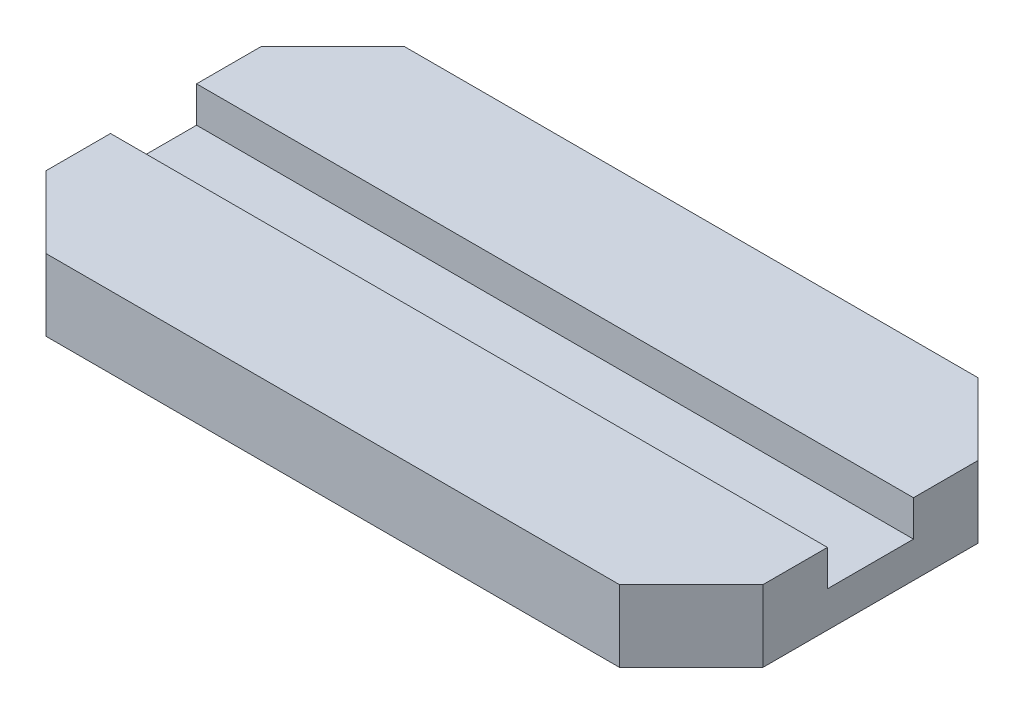
ISO-10303-21;
HEADER;
FILE_DESCRIPTION(('STEP AP214'),'2;1');
FILE_NAME('part.step','',(''),(''),'','','');
FILE_SCHEMA(('AUTOMOTIVE_DESIGN { 1 0 10303 214 1 1 1 1 }'));
ENDSEC;
DATA;
#1=APPLICATION_CONTEXT('core data for automotive mechanical design processes');
#2=APPLICATION_PROTOCOL_DEFINITION('international standard','automotive_design',2000,#1);
#3=PRODUCT_CONTEXT('',#1,'mechanical');
#4=PRODUCT('Part','Part','',(#3));
#5=PRODUCT_RELATED_PRODUCT_CATEGORY('part','',(#4));
#6=PRODUCT_DEFINITION_FORMATION('','',#4);
#7=PRODUCT_DEFINITION_CONTEXT('part definition',#1,'design');
#8=PRODUCT_DEFINITION('design','',#6,#7);
#9=PRODUCT_DEFINITION_SHAPE('','',#8);
#10=(LENGTH_UNIT() NAMED_UNIT(*) SI_UNIT(.MILLI.,.METRE.));
#11=(NAMED_UNIT(*) PLANE_ANGLE_UNIT() SI_UNIT($,.RADIAN.));
#12=(NAMED_UNIT(*) SI_UNIT($,.STERADIAN.) SOLID_ANGLE_UNIT());
#13=UNCERTAINTY_MEASURE_WITH_UNIT(LENGTH_MEASURE(1.E-05),#10,'distance_accuracy_value','');
#14=(GEOMETRIC_REPRESENTATION_CONTEXT(3) GLOBAL_UNCERTAINTY_ASSIGNED_CONTEXT((#13)) GLOBAL_UNIT_ASSIGNED_CONTEXT((#10,
#11,#12)) REPRESENTATION_CONTEXT('',''));
#15=CARTESIAN_POINT('',(0.,0.,0.));
#16=DIRECTION('',(0.,0.,1.));
#17=DIRECTION('',(1.,0.,0.));
#18=AXIS2_PLACEMENT_3D('',#15,#16,#17);
#19=CARTESIAN_POINT('',(0.,10.,0.));
#20=DIRECTION('',(0.,1.,0.));
#21=DIRECTION('',(0.,0.,1.));
#22=AXIS2_PLACEMENT_3D('',#19,#20,#21);
#23=PLANE('',#22);
#24=DIRECTION('',(-1.,0.,0.));
#25=VECTOR('',#24,1.);
#26=CARTESIAN_POINT('',(0.,10.,-6.));
#27=LINE('',#26,#25);
#28=CARTESIAN_POINT('',(50.,10.,-6.));
#29=VERTEX_POINT('',#28);
#30=CARTESIAN_POINT('',(-50.,10.,-6.));
#31=VERTEX_POINT('',#30);
#32=EDGE_CURVE('E55',#29,#31,#27,.T.);
#33=ORIENTED_EDGE('',*,*,#32,.F.);
#34=DIRECTION('',(0.,0.,-1.));
#35=VECTOR('',#34,1.);
#36=CARTESIAN_POINT('',(50.,10.,-25.));
#37=LINE('',#36,#35);
#38=CARTESIAN_POINT('',(50.,10.,-15.));
#39=VERTEX_POINT('',#38);
#40=EDGE_CURVE('E70',#29,#39,#37,.T.);
#41=ORIENTED_EDGE('',*,*,#40,.T.);
#42=DIRECTION('',(0.707106781186547,0.,0.707106781186549));
#43=VECTOR('',#42,1.);
#44=CARTESIAN_POINT('',(32.5,10.,-32.5));
#45=LINE('',#44,#43);
#46=CARTESIAN_POINT('',(40.,10.,-25.));
#47=VERTEX_POINT('',#46);
#48=EDGE_CURVE('E218',#39,#47,#45,.F.);
#49=ORIENTED_EDGE('',*,*,#48,.T.);
#50=DIRECTION('',(-1.,0.,0.));
#51=VECTOR('',#50,1.);
#52=CARTESIAN_POINT('',(-50.,10.,-25.));
#53=LINE('',#52,#51);
#54=CARTESIAN_POINT('',(-40.,10.,-25.));
#55=VERTEX_POINT('',#54);
#56=EDGE_CURVE('E161',#47,#55,#53,.T.);
#57=ORIENTED_EDGE('',*,*,#56,.T.);
#58=DIRECTION('',(0.707106781186549,0.,-0.707106781186547));
#59=VECTOR('',#58,1.);
#60=CARTESIAN_POINT('',(-32.4999999999999,10.,-32.5));
#61=LINE('',#60,#59);
#62=CARTESIAN_POINT('',(-50.,10.,-15.));
#63=VERTEX_POINT('',#62);
#64=EDGE_CURVE('E224',#55,#63,#61,.F.);
#65=ORIENTED_EDGE('',*,*,#64,.T.);
#66=DIRECTION('',(0.,0.,1.));
#67=VECTOR('',#66,1.);
#68=CARTESIAN_POINT('',(-50.,10.,-25.));
#69=LINE('',#68,#67);
#70=EDGE_CURVE('E251',#63,#31,#69,.T.);
#71=ORIENTED_EDGE('',*,*,#70,.T.);
#72=EDGE_LOOP('',(#33,#41,#49,#57,#65,#71));
#73=FACE_BOUND('',#72,.T.);
#74=ADVANCED_FACE('F45',(#73),#23,.T.);
#75=CARTESIAN_POINT('',(-50.,10.,-25.));
#76=DIRECTION('',(1.,0.,0.));
#77=DIRECTION('',(0.,0.,-1.));
#78=AXIS2_PLACEMENT_3D('',#75,#76,#77);
#79=PLANE('',#78);
#80=DIRECTION('',(0.,0.,1.));
#81=VECTOR('',#80,1.);
#82=CARTESIAN_POINT('',(-50.,5.,-25.));
#83=LINE('',#82,#81);
#84=CARTESIAN_POINT('',(-50.,5.,-6.));
#85=VERTEX_POINT('',#84);
#86=CARTESIAN_POINT('',(-50.,5.,6.));
#87=VERTEX_POINT('',#86);
#88=EDGE_CURVE('E177',#85,#87,#83,.T.);
#89=ORIENTED_EDGE('',*,*,#88,.F.);
#90=DIRECTION('',(0.,1.,0.));
#91=VECTOR('',#90,1.);
#92=CARTESIAN_POINT('',(-50.,10.,-6.));
#93=LINE('',#92,#91);
#94=EDGE_CURVE('E243',#85,#31,#93,.T.);
#95=ORIENTED_EDGE('',*,*,#94,.T.);
#96=ORIENTED_EDGE('',*,*,#70,.F.);
#97=DIRECTION('',(0.,-1.,0.));
#98=VECTOR('',#97,1.);
#99=CARTESIAN_POINT('',(-50.,10.,-15.));
#100=LINE('',#99,#98);
#101=CARTESIAN_POINT('',(-50.,0.,-15.));
#102=VERTEX_POINT('',#101);
#103=EDGE_CURVE('E193',#63,#102,#100,.T.);
#104=ORIENTED_EDGE('',*,*,#103,.T.);
#105=DIRECTION('',(0.,0.,1.));
#106=VECTOR('',#105,1.);
#107=CARTESIAN_POINT('',(-50.,0.,-25.));
#108=LINE('',#107,#106);
#109=CARTESIAN_POINT('',(-50.,0.,15.));
#110=VERTEX_POINT('',#109);
#111=EDGE_CURVE('E172',#102,#110,#108,.T.);
#112=ORIENTED_EDGE('',*,*,#111,.T.);
#113=DIRECTION('',(0.,1.,0.));
#114=VECTOR('',#113,1.);
#115=CARTESIAN_POINT('',(-50.,10.,15.));
#116=LINE('',#115,#114);
#117=CARTESIAN_POINT('',(-50.,10.,15.));
#118=VERTEX_POINT('',#117);
#119=EDGE_CURVE('E166',#110,#118,#116,.T.);
#120=ORIENTED_EDGE('',*,*,#119,.T.);
#121=CARTESIAN_POINT('',(-50.,10.,6.));
#122=VERTEX_POINT('',#121);
#123=EDGE_CURVE('E189',#122,#118,#69,.T.);
#124=ORIENTED_EDGE('',*,*,#123,.F.);
#125=DIRECTION('',(0.,-1.,0.));
#126=VECTOR('',#125,1.);
#127=CARTESIAN_POINT('',(-50.,10.,6.));
#128=LINE('',#127,#126);
#129=EDGE_CURVE('E62',#122,#87,#128,.T.);
#130=ORIENTED_EDGE('',*,*,#129,.T.);
#131=EDGE_LOOP('',(#89,#95,#96,#104,#112,#120,#124,#130));
#132=FACE_BOUND('',#131,.T.);
#133=ADVANCED_FACE('F250',(#132),#79,.F.);
#134=CARTESIAN_POINT('',(-50.,10.,25.));
#135=DIRECTION('',(0.,0.,-1.));
#136=DIRECTION('',(-1.,0.,0.));
#137=AXIS2_PLACEMENT_3D('',#134,#135,#136);
#138=PLANE('',#137);
#139=DIRECTION('',(1.,0.,0.));
#140=VECTOR('',#139,1.);
#141=CARTESIAN_POINT('',(-50.,10.,25.));
#142=LINE('',#141,#140);
#143=CARTESIAN_POINT('',(-40.,10.,25.));
#144=VERTEX_POINT('',#143);
#145=CARTESIAN_POINT('',(39.9999999999999,10.,25.));
#146=VERTEX_POINT('',#145);
#147=EDGE_CURVE('E168',#144,#146,#142,.T.);
#148=ORIENTED_EDGE('',*,*,#147,.F.);
#149=DIRECTION('',(0.,-1.,0.));
#150=VECTOR('',#149,1.);
#151=CARTESIAN_POINT('',(-40.,10.,25.));
#152=LINE('',#151,#150);
#153=CARTESIAN_POINT('',(-40.,0.,25.));
#154=VERTEX_POINT('',#153);
#155=EDGE_CURVE('E230',#144,#154,#152,.T.);
#156=ORIENTED_EDGE('',*,*,#155,.T.);
#157=DIRECTION('',(1.,0.,0.));
#158=VECTOR('',#157,1.);
#159=CARTESIAN_POINT('',(-50.,0.,25.));
#160=LINE('',#159,#158);
#161=CARTESIAN_POINT('',(39.9999999999999,0.,25.));
#162=VERTEX_POINT('',#161);
#163=EDGE_CURVE('E176',#154,#162,#160,.T.);
#164=ORIENTED_EDGE('',*,*,#163,.T.);
#165=DIRECTION('',(0.,1.,0.));
#166=VECTOR('',#165,1.);
#167=CARTESIAN_POINT('',(39.9999999999999,10.,25.));
#168=LINE('',#167,#166);
#169=EDGE_CURVE('E227',#162,#146,#168,.T.);
#170=ORIENTED_EDGE('',*,*,#169,.T.);
#171=EDGE_LOOP('',(#148,#156,#164,#170));
#172=FACE_BOUND('',#171,.T.);
#173=ADVANCED_FACE('F278',(#172),#138,.F.);
#174=CARTESIAN_POINT('',(50.,10.,-25.));
#175=DIRECTION('',(-1.,0.,0.));
#176=DIRECTION('',(0.,0.,1.));
#177=AXIS2_PLACEMENT_3D('',#174,#175,#176);
#178=PLANE('',#177);
#179=ORIENTED_EDGE('',*,*,#40,.F.);
#180=DIRECTION('',(0.,-1.,0.));
#181=VECTOR('',#180,1.);
#182=CARTESIAN_POINT('',(50.,10.,-6.));
#183=LINE('',#182,#181);
#184=CARTESIAN_POINT('',(50.,5.,-6.));
#185=VERTEX_POINT('',#184);
#186=EDGE_CURVE('E245',#29,#185,#183,.T.);
#187=ORIENTED_EDGE('',*,*,#186,.T.);
#188=DIRECTION('',(0.,0.,-1.));
#189=VECTOR('',#188,1.);
#190=CARTESIAN_POINT('',(50.,5.,-25.));
#191=LINE('',#190,#189);
#192=CARTESIAN_POINT('',(50.,5.,6.));
#193=VERTEX_POINT('',#192);
#194=EDGE_CURVE('E11',#193,#185,#191,.T.);
#195=ORIENTED_EDGE('',*,*,#194,.F.);
#196=DIRECTION('',(0.,1.,0.));
#197=VECTOR('',#196,1.);
#198=CARTESIAN_POINT('',(50.,10.,6.));
#199=LINE('',#198,#197);
#200=CARTESIAN_POINT('',(50.,10.,6.));
#201=VERTEX_POINT('',#200);
#202=EDGE_CURVE('E137',#193,#201,#199,.T.);
#203=ORIENTED_EDGE('',*,*,#202,.T.);
#204=CARTESIAN_POINT('',(50.,10.,15.));
#205=VERTEX_POINT('',#204);
#206=EDGE_CURVE('E150',#205,#201,#37,.T.);
#207=ORIENTED_EDGE('',*,*,#206,.F.);
#208=DIRECTION('',(0.,-1.,0.));
#209=VECTOR('',#208,1.);
#210=CARTESIAN_POINT('',(50.,10.,15.));
#211=LINE('',#210,#209);
#212=CARTESIAN_POINT('',(50.,0.,15.));
#213=VERTEX_POINT('',#212);
#214=EDGE_CURVE('E234',#205,#213,#211,.T.);
#215=ORIENTED_EDGE('',*,*,#214,.T.);
#216=DIRECTION('',(0.,0.,-1.));
#217=VECTOR('',#216,1.);
#218=CARTESIAN_POINT('',(50.,0.,-25.));
#219=LINE('',#218,#217);
#220=CARTESIAN_POINT('',(50.,0.,-15.));
#221=VERTEX_POINT('',#220);
#222=EDGE_CURVE('E181',#213,#221,#219,.T.);
#223=ORIENTED_EDGE('',*,*,#222,.T.);
#224=DIRECTION('',(0.,1.,0.));
#225=VECTOR('',#224,1.);
#226=CARTESIAN_POINT('',(50.,10.,-15.));
#227=LINE('',#226,#225);
#228=EDGE_CURVE('E143',#221,#39,#227,.T.);
#229=ORIENTED_EDGE('',*,*,#228,.T.);
#230=EDGE_LOOP('',(#179,#187,#195,#203,#207,#215,#223,#229));
#231=FACE_BOUND('',#230,.T.);
#232=ADVANCED_FACE('F148',(#231),#178,.F.);
#233=CARTESIAN_POINT('',(-50.,10.,-25.));
#234=DIRECTION('',(0.,0.,1.));
#235=DIRECTION('',(1.,0.,0.));
#236=AXIS2_PLACEMENT_3D('',#233,#234,#235);
#237=PLANE('',#236);
#238=DIRECTION('',(-1.,0.,0.));
#239=VECTOR('',#238,1.);
#240=CARTESIAN_POINT('',(-50.,0.,-25.));
#241=LINE('',#240,#239);
#242=CARTESIAN_POINT('',(40.,0.,-25.));
#243=VERTEX_POINT('',#242);
#244=CARTESIAN_POINT('',(-40.,0.,-25.));
#245=VERTEX_POINT('',#244);
#246=EDGE_CURVE('E185',#243,#245,#241,.T.);
#247=ORIENTED_EDGE('',*,*,#246,.T.);
#248=DIRECTION('',(0.,1.,0.));
#249=VECTOR('',#248,1.);
#250=CARTESIAN_POINT('',(-40.,10.,-25.));
#251=LINE('',#250,#249);
#252=EDGE_CURVE('E213',#245,#55,#251,.T.);
#253=ORIENTED_EDGE('',*,*,#252,.T.);
#254=ORIENTED_EDGE('',*,*,#56,.F.);
#255=DIRECTION('',(0.,-1.,0.));
#256=VECTOR('',#255,1.);
#257=CARTESIAN_POINT('',(40.,10.,-25.));
#258=LINE('',#257,#256);
#259=EDGE_CURVE('E209',#47,#243,#258,.T.);
#260=ORIENTED_EDGE('',*,*,#259,.T.);
#261=EDGE_LOOP('',(#247,#253,#254,#260));
#262=FACE_BOUND('',#261,.T.);
#263=ADVANCED_FACE('F290',(#262),#237,.F.);
#264=DIRECTION('',(1.,0.,0.));
#265=VECTOR('',#264,1.);
#266=CARTESIAN_POINT('',(0.,10.,6.));
#267=LINE('',#266,#265);
#268=EDGE_CURVE('E134',#122,#201,#267,.T.);
#269=ORIENTED_EDGE('',*,*,#268,.F.);
#270=ORIENTED_EDGE('',*,*,#123,.T.);
#271=DIRECTION('',(-0.707106781186546,0.,-0.707106781186549));
#272=VECTOR('',#271,1.);
#273=CARTESIAN_POINT('',(-32.5000000000001,10.,32.5));
#274=LINE('',#273,#272);
#275=EDGE_CURVE('E221',#118,#144,#274,.F.);
#276=ORIENTED_EDGE('',*,*,#275,.T.);
#277=ORIENTED_EDGE('',*,*,#147,.T.);
#278=DIRECTION('',(-0.707106781186549,0.,0.707106781186546));
#279=VECTOR('',#278,1.);
#280=CARTESIAN_POINT('',(32.4999999999999,10.,32.5));
#281=LINE('',#280,#279);
#282=EDGE_CURVE('E159',#146,#205,#281,.F.);
#283=ORIENTED_EDGE('',*,*,#282,.T.);
#284=ORIENTED_EDGE('',*,*,#206,.T.);
#285=EDGE_LOOP('',(#269,#270,#276,#277,#283,#284));
#286=FACE_BOUND('',#285,.T.);
#287=ADVANCED_FACE('F156',(#286),#23,.T.);
#288=CARTESIAN_POINT('',(0.,0.,0.));
#289=DIRECTION('',(0.,1.,0.));
#290=DIRECTION('',(0.,0.,1.));
#291=AXIS2_PLACEMENT_3D('',#288,#289,#290);
#292=PLANE('',#291);
#293=ORIENTED_EDGE('',*,*,#111,.F.);
#294=DIRECTION('',(-0.707106781186549,0.,0.707106781186547));
#295=VECTOR('',#294,1.);
#296=CARTESIAN_POINT('',(-50.,0.,-15.));
#297=LINE('',#296,#295);
#298=EDGE_CURVE('E206',#102,#245,#297,.F.);
#299=ORIENTED_EDGE('',*,*,#298,.T.);
#300=ORIENTED_EDGE('',*,*,#246,.F.);
#301=DIRECTION('',(-0.707106781186547,0.,-0.707106781186549));
#302=VECTOR('',#301,1.);
#303=CARTESIAN_POINT('',(40.,0.,-25.));
#304=LINE('',#303,#302);
#305=EDGE_CURVE('E200',#243,#221,#304,.F.);
#306=ORIENTED_EDGE('',*,*,#305,.T.);
#307=ORIENTED_EDGE('',*,*,#222,.F.);
#308=DIRECTION('',(0.707106781186549,0.,-0.707106781186546));
#309=VECTOR('',#308,1.);
#310=CARTESIAN_POINT('',(50.,0.,15.));
#311=LINE('',#310,#309);
#312=EDGE_CURVE('E197',#213,#162,#311,.F.);
#313=ORIENTED_EDGE('',*,*,#312,.T.);
#314=ORIENTED_EDGE('',*,*,#163,.F.);
#315=DIRECTION('',(0.707106781186546,0.,0.707106781186549));
#316=VECTOR('',#315,1.);
#317=CARTESIAN_POINT('',(-40.,0.,25.));
#318=LINE('',#317,#316);
#319=EDGE_CURVE('E203',#154,#110,#318,.F.);
#320=ORIENTED_EDGE('',*,*,#319,.T.);
#321=EDGE_LOOP('',(#293,#299,#300,#306,#307,#313,#314,#320));
#322=FACE_BOUND('',#321,.T.);
#323=ADVANCED_FACE('F284',(#322),#292,.F.);
#324=CARTESIAN_POINT('',(-50.,10.,-15.));
#325=DIRECTION('',(0.707106781186547,0.,0.707106781186549));
#326=DIRECTION('',(0.,-1.,0.));
#327=AXIS2_PLACEMENT_3D('',#324,#325,#326);
#328=PLANE('',#327);
#329=ORIENTED_EDGE('',*,*,#64,.F.);
#330=ORIENTED_EDGE('',*,*,#252,.F.);
#331=ORIENTED_EDGE('',*,*,#298,.F.);
#332=ORIENTED_EDGE('',*,*,#103,.F.);
#333=EDGE_LOOP('',(#329,#330,#331,#332));
#334=FACE_BOUND('',#333,.T.);
#335=ADVANCED_FACE('F286',(#334),#328,.F.);
#336=CARTESIAN_POINT('',(-40.,10.,25.));
#337=DIRECTION('',(0.707106781186549,0.,-0.707106781186546));
#338=DIRECTION('',(0.,-1.,0.));
#339=AXIS2_PLACEMENT_3D('',#336,#337,#338);
#340=PLANE('',#339);
#341=ORIENTED_EDGE('',*,*,#275,.F.);
#342=ORIENTED_EDGE('',*,*,#119,.F.);
#343=ORIENTED_EDGE('',*,*,#319,.F.);
#344=ORIENTED_EDGE('',*,*,#155,.F.);
#345=EDGE_LOOP('',(#341,#342,#343,#344));
#346=FACE_BOUND('',#345,.T.);
#347=ADVANCED_FACE('F281',(#346),#340,.F.);
#348=CARTESIAN_POINT('',(40.,10.,-25.));
#349=DIRECTION('',(-0.707106781186549,0.,0.707106781186547));
#350=DIRECTION('',(0.,-1.,0.));
#351=AXIS2_PLACEMENT_3D('',#348,#349,#350);
#352=PLANE('',#351);
#353=ORIENTED_EDGE('',*,*,#48,.F.);
#354=ORIENTED_EDGE('',*,*,#228,.F.);
#355=ORIENTED_EDGE('',*,*,#305,.F.);
#356=ORIENTED_EDGE('',*,*,#259,.F.);
#357=EDGE_LOOP('',(#353,#354,#355,#356));
#358=FACE_BOUND('',#357,.T.);
#359=ADVANCED_FACE('F295',(#358),#352,.F.);
#360=CARTESIAN_POINT('',(50.,10.,15.));
#361=DIRECTION('',(-0.707106781186546,0.,-0.707106781186549));
#362=DIRECTION('',(0.,-1.,0.));
#363=AXIS2_PLACEMENT_3D('',#360,#361,#362);
#364=PLANE('',#363);
#365=ORIENTED_EDGE('',*,*,#282,.F.);
#366=ORIENTED_EDGE('',*,*,#169,.F.);
#367=ORIENTED_EDGE('',*,*,#312,.F.);
#368=ORIENTED_EDGE('',*,*,#214,.F.);
#369=EDGE_LOOP('',(#365,#366,#367,#368));
#370=FACE_BOUND('',#369,.T.);
#371=ADVANCED_FACE('F48',(#370),#364,.F.);
#372=CARTESIAN_POINT('',(0.,5.,0.));
#373=DIRECTION('',(0.,1.,0.));
#374=DIRECTION('',(0.,0.,1.));
#375=AXIS2_PLACEMENT_3D('',#372,#373,#374);
#376=PLANE('',#375);
#377=ORIENTED_EDGE('',*,*,#88,.T.);
#378=DIRECTION('',(1.,0.,0.));
#379=VECTOR('',#378,1.);
#380=CARTESIAN_POINT('',(-58.3808225040527,5.,6.));
#381=LINE('',#380,#379);
#382=EDGE_CURVE('E268',#87,#193,#381,.T.);
#383=ORIENTED_EDGE('',*,*,#382,.T.);
#384=ORIENTED_EDGE('',*,*,#194,.T.);
#385=DIRECTION('',(-1.,0.,0.));
#386=VECTOR('',#385,1.);
#387=CARTESIAN_POINT('',(-58.3808225040527,5.,-6.));
#388=LINE('',#387,#386);
#389=EDGE_CURVE('E154',#185,#85,#388,.T.);
#390=ORIENTED_EDGE('',*,*,#389,.T.);
#391=EDGE_LOOP('',(#377,#383,#384,#390));
#392=FACE_BOUND('',#391,.T.);
#393=ADVANCED_FACE('F271',(#392),#376,.T.);
#394=CARTESIAN_POINT('',(-58.3808225040527,5.,-6.));
#395=DIRECTION('',(0.,0.,-1.));
#396=DIRECTION('',(-1.,0.,0.));
#397=AXIS2_PLACEMENT_3D('',#394,#395,#396);
#398=PLANE('',#397);
#399=ORIENTED_EDGE('',*,*,#389,.F.);
#400=ORIENTED_EDGE('',*,*,#186,.F.);
#401=ORIENTED_EDGE('',*,*,#32,.T.);
#402=ORIENTED_EDGE('',*,*,#94,.F.);
#403=EDGE_LOOP('',(#399,#400,#401,#402));
#404=FACE_BOUND('',#403,.T.);
#405=ADVANCED_FACE('F242',(#404),#398,.F.);
#406=CARTESIAN_POINT('',(-58.3808225040527,5.,6.));
#407=DIRECTION('',(0.,0.,1.));
#408=DIRECTION('',(1.,0.,0.));
#409=AXIS2_PLACEMENT_3D('',#406,#407,#408);
#410=PLANE('',#409);
#411=ORIENTED_EDGE('',*,*,#268,.T.);
#412=ORIENTED_EDGE('',*,*,#202,.F.);
#413=ORIENTED_EDGE('',*,*,#382,.F.);
#414=ORIENTED_EDGE('',*,*,#129,.F.);
#415=EDGE_LOOP('',(#411,#412,#413,#414));
#416=FACE_BOUND('',#415,.T.);
#417=ADVANCED_FACE('F136',(#416),#410,.F.);
#418=CLOSED_SHELL('',(#74,#133,#173,#232,#263,#287,#323,#335,#347,#359,#371,#393,#405,#417));
#419=MANIFOLD_SOLID_BREP('B2',#418);
#420=ADVANCED_BREP_SHAPE_REPRESENTATION('',(#18,#419),#14);
#421=SHAPE_DEFINITION_REPRESENTATION(#9,#420);
ENDSEC;
END-ISO-10303-21;
